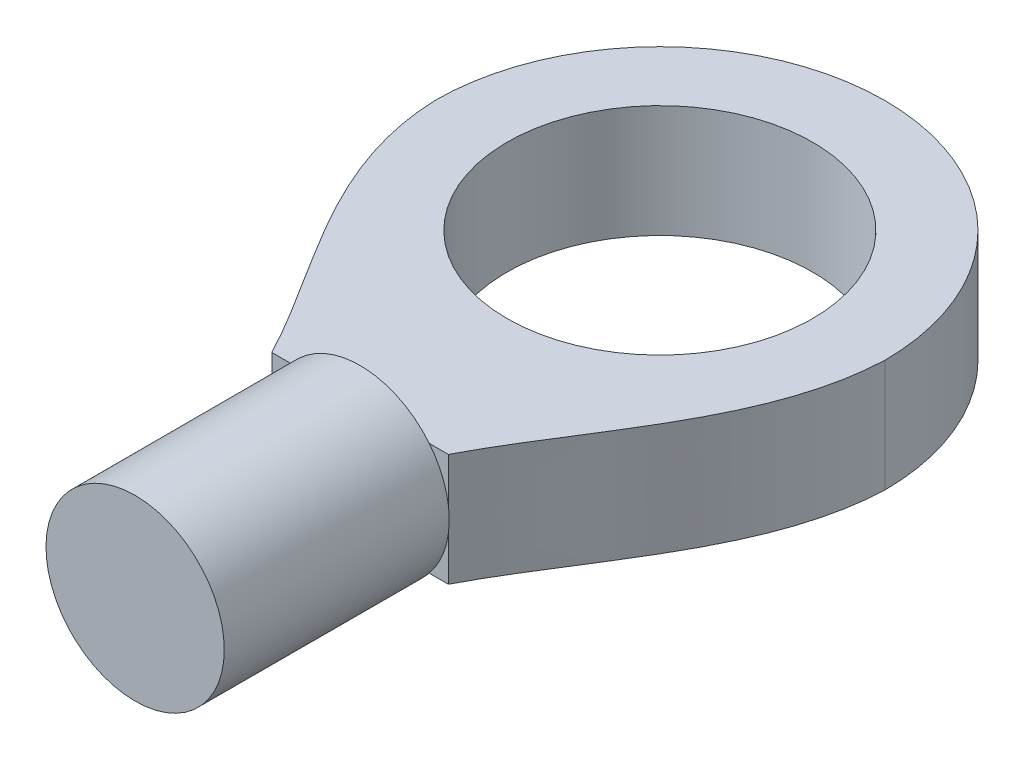
ISO-10303-21;
HEADER;
FILE_DESCRIPTION(('STEP AP214'),'2;1');
FILE_NAME('part.step','',(''),(''),'','','');
FILE_SCHEMA(('AUTOMOTIVE_DESIGN { 1 0 10303 214 1 1 1 1 }'));
ENDSEC;
DATA;
#1=APPLICATION_CONTEXT('core data for automotive mechanical design processes');
#2=APPLICATION_PROTOCOL_DEFINITION('international standard','automotive_design',2000,#1);
#3=PRODUCT_CONTEXT('',#1,'mechanical');
#4=PRODUCT('Part','Part','',(#3));
#5=PRODUCT_RELATED_PRODUCT_CATEGORY('part','',(#4));
#6=PRODUCT_DEFINITION_FORMATION('','',#4);
#7=PRODUCT_DEFINITION_CONTEXT('part definition',#1,'design');
#8=PRODUCT_DEFINITION('design','',#6,#7);
#9=PRODUCT_DEFINITION_SHAPE('','',#8);
#10=(LENGTH_UNIT() NAMED_UNIT(*) SI_UNIT(.MILLI.,.METRE.));
#11=(NAMED_UNIT(*) PLANE_ANGLE_UNIT() SI_UNIT($,.RADIAN.));
#12=(NAMED_UNIT(*) SI_UNIT($,.STERADIAN.) SOLID_ANGLE_UNIT());
#13=UNCERTAINTY_MEASURE_WITH_UNIT(LENGTH_MEASURE(1.E-05),#10,'distance_accuracy_value','');
#14=(GEOMETRIC_REPRESENTATION_CONTEXT(3) GLOBAL_UNCERTAINTY_ASSIGNED_CONTEXT((#13)) GLOBAL_UNIT_ASSIGNED_CONTEXT((#10,
#11,#12)) REPRESENTATION_CONTEXT('',''));
#15=CARTESIAN_POINT('',(0.,0.,0.));
#16=DIRECTION('',(0.,0.,1.));
#17=DIRECTION('',(1.,0.,0.));
#18=AXIS2_PLACEMENT_3D('',#15,#16,#17);
#19=CARTESIAN_POINT('',(0.,6.,15.99));
#20=DIRECTION('',(0.,0.,-1.));
#21=DIRECTION('',(-1.,0.,0.));
#22=AXIS2_PLACEMENT_3D('',#19,#20,#21);
#23=PLANE('',#22);
#24=CARTESIAN_POINT('',(0.,3.,15.99));
#25=DIRECTION('',(0.,0.,1.));
#26=DIRECTION('',(1.,0.,0.));
#27=AXIS2_PLACEMENT_3D('',#24,#25,#26);
#28=CIRCLE('',#27,4.755);
#29=CARTESIAN_POINT('',(4.71,3.65262929753421,15.99));
#30=VERTEX_POINT('',#29);
#31=CARTESIAN_POINT('',(3.68917673743072,6.,15.99));
#32=VERTEX_POINT('',#31);
#33=EDGE_CURVE('E138',#30,#32,#28,.T.);
#34=ORIENTED_EDGE('',*,*,#33,.F.);
#35=DIRECTION('',(0.,-1.,0.));
#36=VECTOR('',#35,1.);
#37=CARTESIAN_POINT('',(4.71,6.,15.99));
#38=LINE('',#37,#36);
#39=CARTESIAN_POINT('',(4.71,6.,15.99));
#40=VERTEX_POINT('',#39);
#41=EDGE_CURVE('E118',#40,#30,#38,.T.);
#42=ORIENTED_EDGE('',*,*,#41,.F.);
#43=DIRECTION('',(1.,0.,0.));
#44=VECTOR('',#43,1.);
#45=CARTESIAN_POINT('',(0.,6.,15.99));
#46=LINE('',#45,#44);
#47=EDGE_CURVE('E248',#32,#40,#46,.T.);
#48=ORIENTED_EDGE('',*,*,#47,.F.);
#49=EDGE_LOOP('',(#34,#42,#48));
#50=FACE_BOUND('',#49,.T.);
#51=ADVANCED_FACE('F39',(#50),#23,.F.);
#52=CARTESIAN_POINT('',(-3.68917673743072,6.,15.99));
#53=VERTEX_POINT('',#52);
#54=CARTESIAN_POINT('',(-4.71,3.65262929753421,15.99));
#55=VERTEX_POINT('',#54);
#56=EDGE_CURVE('E11',#53,#55,#28,.T.);
#57=ORIENTED_EDGE('',*,*,#56,.F.);
#58=CARTESIAN_POINT('',(-4.71,6.,15.99));
#59=VERTEX_POINT('',#58);
#60=EDGE_CURVE('E214',#59,#53,#46,.T.);
#61=ORIENTED_EDGE('',*,*,#60,.F.);
#62=DIRECTION('',(0.,-1.,0.));
#63=VECTOR('',#62,1.);
#64=CARTESIAN_POINT('',(-4.71,6.,15.99));
#65=LINE('',#64,#63);
#66=EDGE_CURVE('E44',#59,#55,#65,.T.);
#67=ORIENTED_EDGE('',*,*,#66,.T.);
#68=EDGE_LOOP('',(#57,#61,#67));
#69=FACE_BOUND('',#68,.T.);
#70=ADVANCED_FACE('F229',(#69),#23,.F.);
#71=CARTESIAN_POINT('',(-4.71,2.34737070246579,15.99));
#72=VERTEX_POINT('',#71);
#73=CARTESIAN_POINT('',(-3.68917673743072,0.,15.99));
#74=VERTEX_POINT('',#73);
#75=EDGE_CURVE('E50',#72,#74,#28,.T.);
#76=ORIENTED_EDGE('',*,*,#75,.F.);
#77=CARTESIAN_POINT('',(-4.71,0.,15.99));
#78=VERTEX_POINT('',#77);
#79=EDGE_CURVE('E145',#72,#78,#65,.T.);
#80=ORIENTED_EDGE('',*,*,#79,.T.);
#81=DIRECTION('',(1.,0.,0.));
#82=VECTOR('',#81,1.);
#83=CARTESIAN_POINT('',(0.,0.,15.99));
#84=LINE('',#83,#82);
#85=EDGE_CURVE('E187',#78,#74,#84,.T.);
#86=ORIENTED_EDGE('',*,*,#85,.T.);
#87=EDGE_LOOP('',(#76,#80,#86));
#88=FACE_BOUND('',#87,.T.);
#89=ADVANCED_FACE('F224',(#88),#23,.F.);
#90=CARTESIAN_POINT('',(-12.,6.,0.));
#91=CARTESIAN_POINT('',(-11.7680045168464,6.,6.14702733167617));
#92=CARTESIAN_POINT('',(-7.32728964840782,6.,10.9528252135243));
#93=CARTESIAN_POINT('',(-4.71,6.,15.99));
#94=B_SPLINE_CURVE_WITH_KNOTS('',3,(#90,#91,#92,#93),.UNSPECIFIED.,.F.,.F.,(4,4),(0.,
0.424868326525699),.UNSPECIFIED.);
#95=DIRECTION('',(0.,-1.,0.));
#96=VECTOR('',#95,1.);
#97=SURFACE_OF_LINEAR_EXTRUSION('',#94,#96);
#98=CARTESIAN_POINT('',(-12.,0.,0.));
#99=CARTESIAN_POINT('',(-11.7680045168464,0.,6.14702733167617));
#100=CARTESIAN_POINT('',(-7.32728964840782,0.,10.9528252135243));
#101=CARTESIAN_POINT('',(-4.71,0.,15.99));
#102=B_SPLINE_CURVE_WITH_KNOTS('',3,(#98,#99,#100,#101),.UNSPECIFIED.,.F.,.F.,(4,4),(0.,
0.424868326525699),.UNSPECIFIED.);
#103=CARTESIAN_POINT('',(-12.,0.,0.));
#104=VERTEX_POINT('',#103);
#105=EDGE_CURVE('E153',#104,#78,#102,.T.);
#106=ORIENTED_EDGE('',*,*,#105,.T.);
#107=ORIENTED_EDGE('',*,*,#79,.F.);
#108=EDGE_CURVE('E65',#55,#72,#65,.T.);
#109=ORIENTED_EDGE('',*,*,#108,.F.);
#110=ORIENTED_EDGE('',*,*,#66,.F.);
#111=CARTESIAN_POINT('',(-12.,6.,0.));
#112=VERTEX_POINT('',#111);
#113=EDGE_CURVE('E178',#112,#59,#94,.T.);
#114=ORIENTED_EDGE('',*,*,#113,.F.);
#115=DIRECTION('',(0.,-1.,0.));
#116=VECTOR('',#115,1.);
#117=CARTESIAN_POINT('',(-12.,6.,0.));
#118=LINE('',#117,#116);
#119=EDGE_CURVE('E169',#112,#104,#118,.T.);
#120=ORIENTED_EDGE('',*,*,#119,.T.);
#121=EDGE_LOOP('',(#106,#107,#109,#110,#114,#120));
#122=FACE_BOUND('',#121,.T.);
#123=ADVANCED_FACE('F41',(#122),#97,.F.);
#124=CARTESIAN_POINT('',(3.68917673743072,0.,15.99));
#125=VERTEX_POINT('',#124);
#126=CARTESIAN_POINT('',(4.71,2.34737070246579,15.99));
#127=VERTEX_POINT('',#126);
#128=EDGE_CURVE('E126',#125,#127,#28,.T.);
#129=ORIENTED_EDGE('',*,*,#128,.F.);
#130=CARTESIAN_POINT('',(4.71,0.,15.99));
#131=VERTEX_POINT('',#130);
#132=EDGE_CURVE('E128',#125,#131,#84,.T.);
#133=ORIENTED_EDGE('',*,*,#132,.T.);
#134=EDGE_CURVE('E114',#127,#131,#38,.T.);
#135=ORIENTED_EDGE('',*,*,#134,.F.);
#136=EDGE_LOOP('',(#129,#133,#135));
#137=FACE_BOUND('',#136,.T.);
#138=ADVANCED_FACE('F124',(#137),#23,.F.);
#139=CARTESIAN_POINT('',(12.,6.,0.));
#140=CARTESIAN_POINT('',(11.7680045168464,6.,6.14702733167617));
#141=CARTESIAN_POINT('',(7.32728964840783,6.,10.9528252135243));
#142=CARTESIAN_POINT('',(4.71,6.,15.99));
#143=B_SPLINE_CURVE_WITH_KNOTS('',3,(#139,#140,#141,#142),.UNSPECIFIED.,.F.,.F.,(4,4),(0.,
0.424868326525699),.UNSPECIFIED.);
#144=DIRECTION('',(0.,-1.,0.));
#145=VECTOR('',#144,1.);
#146=SURFACE_OF_LINEAR_EXTRUSION('',#143,#145);
#147=CARTESIAN_POINT('',(12.,0.,0.));
#148=CARTESIAN_POINT('',(11.7680045168464,0.,6.14702733167617));
#149=CARTESIAN_POINT('',(7.32728964840783,0.,10.9528252135243));
#150=CARTESIAN_POINT('',(4.71,0.,15.99));
#151=B_SPLINE_CURVE_WITH_KNOTS('',3,(#147,#148,#149,#150),.UNSPECIFIED.,.F.,.F.,(4,4),(0.,
0.424868326525699),.UNSPECIFIED.);
#152=CARTESIAN_POINT('',(12.,0.,0.));
#153=VERTEX_POINT('',#152);
#154=EDGE_CURVE('E182',#153,#131,#151,.T.);
#155=ORIENTED_EDGE('',*,*,#154,.F.);
#156=DIRECTION('',(0.,-1.,0.));
#157=VECTOR('',#156,1.);
#158=CARTESIAN_POINT('',(12.,6.,0.));
#159=LINE('',#158,#157);
#160=CARTESIAN_POINT('',(12.,6.,0.));
#161=VERTEX_POINT('',#160);
#162=EDGE_CURVE('E131',#161,#153,#159,.T.);
#163=ORIENTED_EDGE('',*,*,#162,.F.);
#164=EDGE_CURVE('E208',#161,#40,#143,.T.);
#165=ORIENTED_EDGE('',*,*,#164,.T.);
#166=ORIENTED_EDGE('',*,*,#41,.T.);
#167=EDGE_CURVE('E110',#30,#127,#38,.T.);
#168=ORIENTED_EDGE('',*,*,#167,.T.);
#169=ORIENTED_EDGE('',*,*,#134,.T.);
#170=EDGE_LOOP('',(#155,#163,#165,#166,#168,#169));
#171=FACE_BOUND('',#170,.T.);
#172=ADVANCED_FACE('F113',(#171),#146,.T.);
#173=CARTESIAN_POINT('',(0.,6.,0.));
#174=DIRECTION('',(0.,-1.,0.));
#175=DIRECTION('',(0.,0.,-1.));
#176=AXIS2_PLACEMENT_3D('',#173,#174,#175);
#177=CYLINDRICAL_SURFACE('',#176,12.);
#178=CARTESIAN_POINT('',(0.,0.,0.));
#179=DIRECTION('',(0.,1.,0.));
#180=DIRECTION('',(0.,0.,1.));
#181=AXIS2_PLACEMENT_3D('',#178,#179,#180);
#182=CIRCLE('',#181,12.);
#183=EDGE_CURVE('E179',#153,#104,#182,.T.);
#184=ORIENTED_EDGE('',*,*,#183,.T.);
#185=ORIENTED_EDGE('',*,*,#119,.F.);
#186=CARTESIAN_POINT('',(0.,6.,0.));
#187=DIRECTION('',(0.,1.,0.));
#188=DIRECTION('',(0.,0.,1.));
#189=AXIS2_PLACEMENT_3D('',#186,#187,#188);
#190=CIRCLE('',#189,12.);
#191=EDGE_CURVE('E205',#161,#112,#190,.T.);
#192=ORIENTED_EDGE('',*,*,#191,.F.);
#193=ORIENTED_EDGE('',*,*,#162,.T.);
#194=EDGE_LOOP('',(#184,#185,#192,#193));
#195=FACE_BOUND('',#194,.T.);
#196=ADVANCED_FACE('F221',(#195),#177,.T.);
#197=CARTESIAN_POINT('',(0.,6.,0.));
#198=DIRECTION('',(0.,-1.,0.));
#199=DIRECTION('',(0.,0.,-1.));
#200=AXIS2_PLACEMENT_3D('',#197,#198,#199);
#201=CYLINDRICAL_SURFACE('',#200,8.15);
#202=CARTESIAN_POINT('',(0.,6.,0.));
#203=DIRECTION('',(0.,1.,0.));
#204=DIRECTION('',(0.,0.,1.));
#205=AXIS2_PLACEMENT_3D('',#202,#203,#204);
#206=CIRCLE('',#205,8.15);
#207=CARTESIAN_POINT('',(0.,6.,8.15));
#208=VERTEX_POINT('',#207);
#209=EDGE_CURVE('E173',#208,#208,#206,.T.);
#210=ORIENTED_EDGE('',*,*,#209,.T.);
#211=EDGE_LOOP('',(#210));
#212=FACE_BOUND('',#211,.T.);
#213=CARTESIAN_POINT('',(0.,0.,0.));
#214=DIRECTION('',(0.,1.,0.));
#215=DIRECTION('',(0.,0.,1.));
#216=AXIS2_PLACEMENT_3D('',#213,#214,#215);
#217=CIRCLE('',#216,8.15);
#218=CARTESIAN_POINT('',(0.,0.,8.15));
#219=VERTEX_POINT('',#218);
#220=EDGE_CURVE('E174',#219,#219,#217,.T.);
#221=ORIENTED_EDGE('',*,*,#220,.F.);
#222=EDGE_LOOP('',(#221));
#223=FACE_BOUND('',#222,.T.);
#224=ADVANCED_FACE('F275',(#212,#223),#201,.F.);
#225=CARTESIAN_POINT('',(0.,6.,0.));
#226=DIRECTION('',(0.,1.,0.));
#227=DIRECTION('',(0.,0.,1.));
#228=AXIS2_PLACEMENT_3D('',#225,#226,#227);
#229=PLANE('',#228);
#230=ORIENTED_EDGE('',*,*,#113,.T.);
#231=ORIENTED_EDGE('',*,*,#60,.T.);
#232=EDGE_CURVE('E245',#53,#32,#46,.T.);
#233=ORIENTED_EDGE('',*,*,#232,.T.);
#234=ORIENTED_EDGE('',*,*,#47,.T.);
#235=ORIENTED_EDGE('',*,*,#164,.F.);
#236=ORIENTED_EDGE('',*,*,#191,.T.);
#237=EDGE_LOOP('',(#230,#231,#233,#234,#235,#236));
#238=FACE_BOUND('',#237,.T.);
#239=ORIENTED_EDGE('',*,*,#209,.F.);
#240=EDGE_LOOP('',(#239));
#241=FACE_BOUND('',#240,.T.);
#242=ADVANCED_FACE('F243',(#238,#241),#229,.T.);
#243=CARTESIAN_POINT('',(0.,0.,0.));
#244=DIRECTION('',(0.,1.,0.));
#245=DIRECTION('',(0.,0.,1.));
#246=AXIS2_PLACEMENT_3D('',#243,#244,#245);
#247=PLANE('',#246);
#248=ORIENTED_EDGE('',*,*,#105,.F.);
#249=ORIENTED_EDGE('',*,*,#183,.F.);
#250=ORIENTED_EDGE('',*,*,#154,.T.);
#251=ORIENTED_EDGE('',*,*,#132,.F.);
#252=EDGE_CURVE('E193',#74,#125,#84,.T.);
#253=ORIENTED_EDGE('',*,*,#252,.F.);
#254=ORIENTED_EDGE('',*,*,#85,.F.);
#255=EDGE_LOOP('',(#248,#249,#250,#251,#253,#254));
#256=FACE_BOUND('',#255,.T.);
#257=ORIENTED_EDGE('',*,*,#220,.T.);
#258=EDGE_LOOP('',(#257));
#259=FACE_BOUND('',#258,.T.);
#260=ADVANCED_FACE('F268',(#256,#259),#247,.F.);
#261=CARTESIAN_POINT('',(0.,3.,15.99));
#262=DIRECTION('',(0.,0.,1.));
#263=DIRECTION('',(1.,0.,0.));
#264=AXIS2_PLACEMENT_3D('',#261,#262,#263);
#265=PLANE('',#264);
#266=EDGE_CURVE('E137',#74,#125,#28,.T.);
#267=ORIENTED_EDGE('',*,*,#266,.F.);
#268=ORIENTED_EDGE('',*,*,#252,.T.);
#269=EDGE_LOOP('',(#267,#268));
#270=FACE_BOUND('',#269,.T.);
#271=ADVANCED_FACE('F265',(#270),#265,.F.);
#272=ORIENTED_EDGE('',*,*,#167,.F.);
#273=EDGE_CURVE('E132',#127,#30,#28,.T.);
#274=ORIENTED_EDGE('',*,*,#273,.F.);
#275=EDGE_LOOP('',(#272,#274));
#276=FACE_BOUND('',#275,.T.);
#277=ADVANCED_FACE('F133',(#276),#265,.F.);
#278=EDGE_CURVE('E154',#55,#72,#28,.T.);
#279=ORIENTED_EDGE('',*,*,#278,.F.);
#280=ORIENTED_EDGE('',*,*,#108,.T.);
#281=EDGE_LOOP('',(#279,#280));
#282=FACE_BOUND('',#281,.T.);
#283=ADVANCED_FACE('F161',(#282),#265,.F.);
#284=CARTESIAN_POINT('',(0.,3.,27.99));
#285=DIRECTION('',(0.,0.,-1.));
#286=DIRECTION('',(-1.,0.,0.));
#287=AXIS2_PLACEMENT_3D('',#284,#285,#286);
#288=CYLINDRICAL_SURFACE('',#287,4.755);
#289=CARTESIAN_POINT('',(0.,3.,27.99));
#290=DIRECTION('',(0.,0.,1.));
#291=DIRECTION('',(1.,0.,0.));
#292=AXIS2_PLACEMENT_3D('',#289,#290,#291);
#293=CIRCLE('',#292,4.755);
#294=CARTESIAN_POINT('',(4.755,3.,27.99));
#295=VERTEX_POINT('',#294);
#296=EDGE_CURVE('E148',#295,#295,#293,.T.);
#297=ORIENTED_EDGE('',*,*,#296,.F.);
#298=EDGE_LOOP('',(#297));
#299=FACE_BOUND('',#298,.T.);
#300=ORIENTED_EDGE('',*,*,#33,.T.);
#301=EDGE_CURVE('E52',#32,#53,#28,.T.);
#302=ORIENTED_EDGE('',*,*,#301,.T.);
#303=ORIENTED_EDGE('',*,*,#56,.T.);
#304=ORIENTED_EDGE('',*,*,#278,.T.);
#305=ORIENTED_EDGE('',*,*,#75,.T.);
#306=ORIENTED_EDGE('',*,*,#266,.T.);
#307=ORIENTED_EDGE('',*,*,#128,.T.);
#308=ORIENTED_EDGE('',*,*,#273,.T.);
#309=EDGE_LOOP('',(#300,#302,#303,#304,#305,#306,#307,#308));
#310=FACE_BOUND('',#309,.T.);
#311=ADVANCED_FACE('F140',(#299,#310),#288,.T.);
#312=CARTESIAN_POINT('',(0.,3.,27.99));
#313=DIRECTION('',(0.,0.,1.));
#314=DIRECTION('',(1.,0.,0.));
#315=AXIS2_PLACEMENT_3D('',#312,#313,#314);
#316=PLANE('',#315);
#317=ORIENTED_EDGE('',*,*,#296,.T.);
#318=EDGE_LOOP('',(#317));
#319=FACE_BOUND('',#318,.T.);
#320=ADVANCED_FACE('F290',(#319),#316,.T.);
#321=ORIENTED_EDGE('',*,*,#232,.F.);
#322=ORIENTED_EDGE('',*,*,#301,.F.);
#323=EDGE_LOOP('',(#321,#322));
#324=FACE_BOUND('',#323,.T.);
#325=ADVANCED_FACE('F250',(#324),#265,.F.);
#326=CLOSED_SHELL('',(#51,#70,#89,#123,#138,#172,#196,#224,#242,#260,#271,#277,#283,#311,#320,#325));
#327=MANIFOLD_SOLID_BREP('B2',#326);
#328=ADVANCED_BREP_SHAPE_REPRESENTATION('',(#18,#327),#14);
#329=SHAPE_DEFINITION_REPRESENTATION(#9,#328);
ENDSEC;
END-ISO-10303-21;
